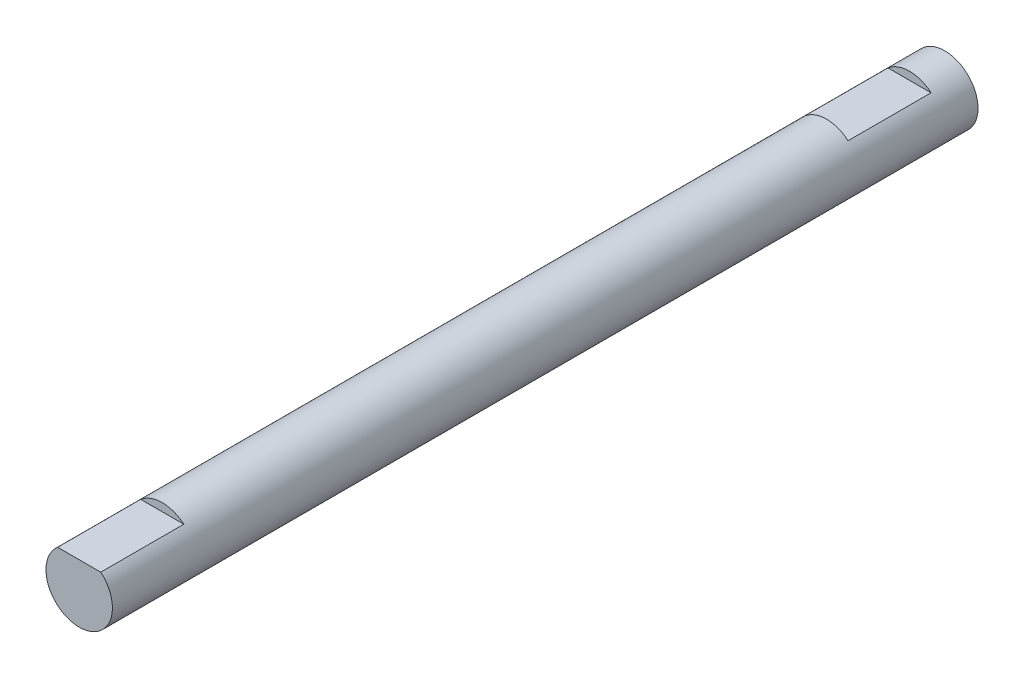
ISO-10303-21;
HEADER;
FILE_DESCRIPTION(('STEP AP214'),'2;1');
FILE_NAME('part.step','',(''),(''),'','','');
FILE_SCHEMA(('AUTOMOTIVE_DESIGN { 1 0 10303 214 1 1 1 1 }'));
ENDSEC;
DATA;
#1=APPLICATION_CONTEXT('core data for automotive mechanical design processes');
#2=APPLICATION_PROTOCOL_DEFINITION('international standard','automotive_design',2000,#1);
#3=PRODUCT_CONTEXT('',#1,'mechanical');
#4=PRODUCT('Part','Part','',(#3));
#5=PRODUCT_RELATED_PRODUCT_CATEGORY('part','',(#4));
#6=PRODUCT_DEFINITION_FORMATION('','',#4);
#7=PRODUCT_DEFINITION_CONTEXT('part definition',#1,'design');
#8=PRODUCT_DEFINITION('design','',#6,#7);
#9=PRODUCT_DEFINITION_SHAPE('','',#8);
#10=(LENGTH_UNIT() NAMED_UNIT(*) SI_UNIT(.MILLI.,.METRE.));
#11=(NAMED_UNIT(*) PLANE_ANGLE_UNIT() SI_UNIT($,.RADIAN.));
#12=(NAMED_UNIT(*) SI_UNIT($,.STERADIAN.) SOLID_ANGLE_UNIT());
#13=UNCERTAINTY_MEASURE_WITH_UNIT(LENGTH_MEASURE(1.E-05),#10,'distance_accuracy_value','');
#14=(GEOMETRIC_REPRESENTATION_CONTEXT(3) GLOBAL_UNCERTAINTY_ASSIGNED_CONTEXT((#13)) GLOBAL_UNIT_ASSIGNED_CONTEXT((#10,
#11,#12)) REPRESENTATION_CONTEXT('',''));
#15=CARTESIAN_POINT('',(0.,0.,0.));
#16=DIRECTION('',(0.,0.,1.));
#17=DIRECTION('',(1.,0.,0.));
#18=AXIS2_PLACEMENT_3D('',#15,#16,#17);
#19=CARTESIAN_POINT('',(2.78880516684604,15.1989881593111,104.25));
#20=DIRECTION('',(0.,0.,-1.));
#21=DIRECTION('',(-1.,0.,0.));
#22=AXIS2_PLACEMENT_3D('',#19,#20,#21);
#23=CYLINDRICAL_SURFACE('',#22,4.);
#24=CARTESIAN_POINT('',(2.78880516684604,15.1989881593111,0.));
#25=DIRECTION('',(0.,0.,1.));
#26=DIRECTION('',(1.,0.,0.));
#27=AXIS2_PLACEMENT_3D('',#24,#25,#26);
#28=CIRCLE('',#27,4.);
#29=CARTESIAN_POINT('',(6.78880516684604,15.1989881593111,0.));
#30=VERTEX_POINT('',#29);
#31=EDGE_CURVE('E104',#30,#30,#28,.T.);
#32=ORIENTED_EDGE('',*,*,#31,.T.);
#33=EDGE_LOOP('',(#32));
#34=FACE_BOUND('',#33,.T.);
#35=CARTESIAN_POINT('',(2.78880516684604,15.1989881593111,104.25));
#36=DIRECTION('',(0.,0.,1.));
#37=DIRECTION('',(1.,0.,0.));
#38=AXIS2_PLACEMENT_3D('',#35,#36,#37);
#39=CIRCLE('',#38,4.);
#40=CARTESIAN_POINT('',(0.191673368427304,18.2411759282764,104.25));
#41=VERTEX_POINT('',#40);
#42=CARTESIAN_POINT('',(5.38593696526478,18.2411759282764,104.25));
#43=VERTEX_POINT('',#42);
#44=EDGE_CURVE('E103',#41,#43,#39,.T.);
#45=ORIENTED_EDGE('',*,*,#44,.F.);
#46=DIRECTION('',(0.,0.,-1.));
#47=VECTOR('',#46,1.);
#48=CARTESIAN_POINT('',(0.191673368427304,18.2411759282764,104.25));
#49=LINE('',#48,#47);
#50=CARTESIAN_POINT('',(0.191673368427304,18.2411759282764,94.25));
#51=VERTEX_POINT('',#50);
#52=EDGE_CURVE('E66',#41,#51,#49,.T.);
#53=ORIENTED_EDGE('',*,*,#52,.T.);
#54=CARTESIAN_POINT('',(2.78880516684604,15.1989881593111,94.25));
#55=DIRECTION('',(0.,0.,1.));
#56=DIRECTION('',(1.,0.,0.));
#57=AXIS2_PLACEMENT_3D('',#54,#55,#56);
#58=CIRCLE('',#57,4.);
#59=CARTESIAN_POINT('',(5.38593696526478,18.2411759282764,94.25));
#60=VERTEX_POINT('',#59);
#61=EDGE_CURVE('E89',#60,#51,#58,.T.);
#62=ORIENTED_EDGE('',*,*,#61,.F.);
#63=DIRECTION('',(0.,0.,-1.));
#64=VECTOR('',#63,1.);
#65=CARTESIAN_POINT('',(5.38593696526478,18.2411759282764,104.25));
#66=LINE('',#65,#64);
#67=EDGE_CURVE('E110',#60,#43,#66,.F.);
#68=ORIENTED_EDGE('',*,*,#67,.T.);
#69=EDGE_LOOP('',(#45,#53,#62,#68));
#70=FACE_BOUND('',#69,.T.);
#71=CARTESIAN_POINT('',(2.78880516684604,15.1989881593111,14.25));
#72=DIRECTION('',(0.,0.,-1.));
#73=DIRECTION('',(-1.,0.,0.));
#74=AXIS2_PLACEMENT_3D('',#71,#72,#73);
#75=CIRCLE('',#74,4.);
#76=CARTESIAN_POINT('',(0.191673368427304,18.2411759282764,14.25));
#77=VERTEX_POINT('',#76);
#78=CARTESIAN_POINT('',(5.38593696526478,18.2411759282764,14.25));
#79=VERTEX_POINT('',#78);
#80=EDGE_CURVE('E13',#77,#79,#75,.T.);
#81=ORIENTED_EDGE('',*,*,#80,.F.);
#82=DIRECTION('',(0.,0.,-1.));
#83=VECTOR('',#82,1.);
#84=CARTESIAN_POINT('',(0.191673368427304,18.2411759282764,104.25));
#85=LINE('',#84,#83);
#86=CARTESIAN_POINT('',(0.191673368427304,18.2411759282764,4.24999999999999));
#87=VERTEX_POINT('',#86);
#88=EDGE_CURVE('E88',#87,#77,#85,.F.);
#89=ORIENTED_EDGE('',*,*,#88,.F.);
#90=CARTESIAN_POINT('',(2.78880516684604,15.1989881593111,4.24999999999999));
#91=DIRECTION('',(0.,0.,-1.));
#92=DIRECTION('',(-1.,0.,0.));
#93=AXIS2_PLACEMENT_3D('',#90,#91,#92);
#94=CIRCLE('',#93,4.);
#95=CARTESIAN_POINT('',(5.38593696526478,18.2411759282764,4.24999999999999));
#96=VERTEX_POINT('',#95);
#97=EDGE_CURVE('E83',#87,#96,#94,.T.);
#98=ORIENTED_EDGE('',*,*,#97,.T.);
#99=DIRECTION('',(0.,0.,-1.));
#100=VECTOR('',#99,1.);
#101=CARTESIAN_POINT('',(5.38593696526478,18.2411759282764,104.25));
#102=LINE('',#101,#100);
#103=EDGE_CURVE('E52',#79,#96,#102,.T.);
#104=ORIENTED_EDGE('',*,*,#103,.F.);
#105=EDGE_LOOP('',(#81,#89,#98,#104));
#106=FACE_BOUND('',#105,.T.);
#107=ADVANCED_FACE('F45',(#34,#70,#106),#23,.T.);
#108=CARTESIAN_POINT('',(2.78880516684604,15.1989881593111,104.25));
#109=DIRECTION('',(0.,0.,1.));
#110=DIRECTION('',(1.,0.,0.));
#111=AXIS2_PLACEMENT_3D('',#108,#109,#110);
#112=PLANE('',#111);
#113=DIRECTION('',(1.,0.,0.));
#114=VECTOR('',#113,1.);
#115=CARTESIAN_POINT('',(2.78880516684604,18.2411759282764,104.25));
#116=LINE('',#115,#114);
#117=EDGE_CURVE('E101',#41,#43,#116,.T.);
#118=ORIENTED_EDGE('',*,*,#117,.F.);
#119=ORIENTED_EDGE('',*,*,#44,.T.);
#120=EDGE_LOOP('',(#118,#119));
#121=FACE_BOUND('',#120,.T.);
#122=ADVANCED_FACE('F128',(#121),#112,.T.);
#123=CARTESIAN_POINT('',(2.78880516684604,15.1989881593111,0.));
#124=DIRECTION('',(0.,0.,1.));
#125=DIRECTION('',(1.,0.,0.));
#126=AXIS2_PLACEMENT_3D('',#123,#124,#125);
#127=PLANE('',#126);
#128=ORIENTED_EDGE('',*,*,#31,.F.);
#129=EDGE_LOOP('',(#128));
#130=FACE_BOUND('',#129,.T.);
#131=ADVANCED_FACE('F133',(#130),#127,.F.);
#132=CARTESIAN_POINT('',(0.,0.,94.25));
#133=DIRECTION('',(0.,0.,1.));
#134=DIRECTION('',(1.,0.,0.));
#135=AXIS2_PLACEMENT_3D('',#132,#133,#134);
#136=PLANE('',#135);
#137=ORIENTED_EDGE('',*,*,#61,.T.);
#138=DIRECTION('',(1.,0.,0.));
#139=VECTOR('',#138,1.);
#140=CARTESIAN_POINT('',(-1.45182020807484,18.2411759282764,94.25));
#141=LINE('',#140,#139);
#142=EDGE_CURVE('E113',#51,#60,#141,.T.);
#143=ORIENTED_EDGE('',*,*,#142,.T.);
#144=EDGE_LOOP('',(#137,#143));
#145=FACE_BOUND('',#144,.T.);
#146=ADVANCED_FACE('F141',(#145),#136,.T.);
#147=CARTESIAN_POINT('',(-1.21119483315396,18.2411759282764,94.25));
#148=DIRECTION('',(0.,-1.,0.));
#149=DIRECTION('',(0.,0.,-1.));
#150=AXIS2_PLACEMENT_3D('',#147,#148,#149);
#151=PLANE('',#150);
#152=ORIENTED_EDGE('',*,*,#117,.T.);
#153=ORIENTED_EDGE('',*,*,#67,.F.);
#154=ORIENTED_EDGE('',*,*,#142,.F.);
#155=ORIENTED_EDGE('',*,*,#52,.F.);
#156=EDGE_LOOP('',(#152,#153,#154,#155));
#157=FACE_BOUND('',#156,.T.);
#158=ADVANCED_FACE('F125',(#157),#151,.F.);
#159=CARTESIAN_POINT('',(-1.21119483315396,18.2411759282764,14.25));
#160=DIRECTION('',(0.,1.,0.));
#161=DIRECTION('',(0.,0.,1.));
#162=AXIS2_PLACEMENT_3D('',#159,#160,#161);
#163=PLANE('',#162);
#164=ORIENTED_EDGE('',*,*,#103,.T.);
#165=DIRECTION('',(1.,0.,0.));
#166=VECTOR('',#165,1.);
#167=CARTESIAN_POINT('',(-1.21119483315396,18.2411759282764,4.24999999999999));
#168=LINE('',#167,#166);
#169=EDGE_CURVE('E58',#87,#96,#168,.T.);
#170=ORIENTED_EDGE('',*,*,#169,.F.);
#171=ORIENTED_EDGE('',*,*,#88,.T.);
#172=DIRECTION('',(1.,0.,0.));
#173=VECTOR('',#172,1.);
#174=CARTESIAN_POINT('',(-1.45182020807484,18.2411759282764,14.25));
#175=LINE('',#174,#173);
#176=EDGE_CURVE('E95',#77,#79,#175,.T.);
#177=ORIENTED_EDGE('',*,*,#176,.T.);
#178=EDGE_LOOP('',(#164,#170,#171,#177));
#179=FACE_BOUND('',#178,.T.);
#180=ADVANCED_FACE('F92',(#179),#163,.T.);
#181=CARTESIAN_POINT('',(0.,0.,14.25));
#182=DIRECTION('',(0.,0.,-1.));
#183=DIRECTION('',(1.,0.,0.));
#184=AXIS2_PLACEMENT_3D('',#181,#182,#183);
#185=PLANE('',#184);
#186=ORIENTED_EDGE('',*,*,#80,.T.);
#187=ORIENTED_EDGE('',*,*,#176,.F.);
#188=EDGE_LOOP('',(#186,#187));
#189=FACE_BOUND('',#188,.T.);
#190=ADVANCED_FACE('F117',(#189),#185,.T.);
#191=CARTESIAN_POINT('',(0.,0.,4.24999999999999));
#192=DIRECTION('',(0.,0.,-1.));
#193=DIRECTION('',(1.,0.,0.));
#194=AXIS2_PLACEMENT_3D('',#191,#192,#193);
#195=PLANE('',#194);
#196=ORIENTED_EDGE('',*,*,#169,.T.);
#197=ORIENTED_EDGE('',*,*,#97,.F.);
#198=EDGE_LOOP('',(#196,#197));
#199=FACE_BOUND('',#198,.T.);
#200=ADVANCED_FACE('F84',(#199),#195,.F.);
#201=CLOSED_SHELL('',(#107,#122,#131,#146,#158,#180,#190,#200));
#202=MANIFOLD_SOLID_BREP('B2',#201);
#203=ADVANCED_BREP_SHAPE_REPRESENTATION('',(#18,#202),#14);
#204=SHAPE_DEFINITION_REPRESENTATION(#9,#203);
ENDSEC;
END-ISO-10303-21;
